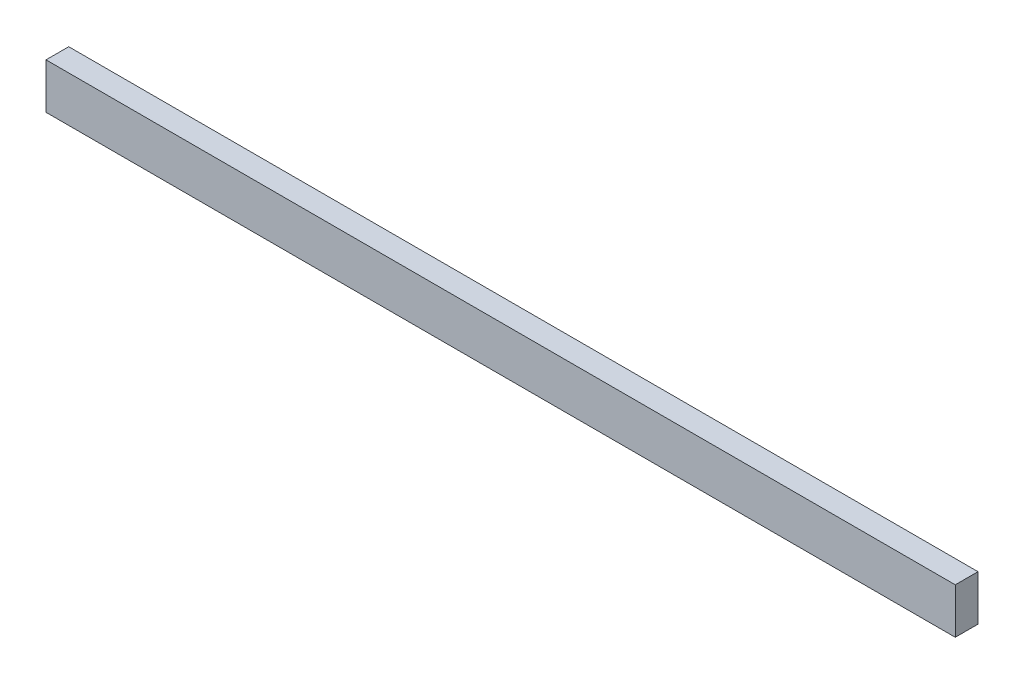
ISO-10303-21;
HEADER;
FILE_DESCRIPTION(('STEP AP214'),'2;1');
FILE_NAME('part.step','',(''),(''),'','','');
FILE_SCHEMA(('AUTOMOTIVE_DESIGN { 1 0 10303 214 1 1 1 1 }'));
ENDSEC;
DATA;
#1=APPLICATION_CONTEXT('core data for automotive mechanical design processes');
#2=APPLICATION_PROTOCOL_DEFINITION('international standard','automotive_design',2000,#1);
#3=PRODUCT_CONTEXT('',#1,'mechanical');
#4=PRODUCT('Part','Part','',(#3));
#5=PRODUCT_RELATED_PRODUCT_CATEGORY('part','',(#4));
#6=PRODUCT_DEFINITION_FORMATION('','',#4);
#7=PRODUCT_DEFINITION_CONTEXT('part definition',#1,'design');
#8=PRODUCT_DEFINITION('design','',#6,#7);
#9=PRODUCT_DEFINITION_SHAPE('','',#8);
#10=(LENGTH_UNIT() NAMED_UNIT(*) SI_UNIT(.MILLI.,.METRE.));
#11=(NAMED_UNIT(*) PLANE_ANGLE_UNIT() SI_UNIT($,.RADIAN.));
#12=(NAMED_UNIT(*) SI_UNIT($,.STERADIAN.) SOLID_ANGLE_UNIT());
#13=UNCERTAINTY_MEASURE_WITH_UNIT(LENGTH_MEASURE(1.E-05),#10,'distance_accuracy_value','');
#14=(GEOMETRIC_REPRESENTATION_CONTEXT(3) GLOBAL_UNCERTAINTY_ASSIGNED_CONTEXT((#13)) GLOBAL_UNIT_ASSIGNED_CONTEXT((#10,
#11,#12)) REPRESENTATION_CONTEXT('',''));
#15=CARTESIAN_POINT('',(0.,0.,0.));
#16=DIRECTION('',(0.,0.,1.));
#17=DIRECTION('',(1.,0.,0.));
#18=AXIS2_PLACEMENT_3D('',#15,#16,#17);
#19=CARTESIAN_POINT('',(127.,-6.35,6.35));
#20=DIRECTION('',(-1.,0.,0.));
#21=DIRECTION('',(0.,0.,1.));
#22=AXIS2_PLACEMENT_3D('',#19,#20,#21);
#23=PLANE('',#22);
#24=DIRECTION('',(0.,1.,0.));
#25=VECTOR('',#24,1.);
#26=CARTESIAN_POINT('',(127.,-6.35,0.));
#27=LINE('',#26,#25);
#28=CARTESIAN_POINT('',(127.,-6.35,0.));
#29=VERTEX_POINT('',#28);
#30=CARTESIAN_POINT('',(127.,6.35,0.));
#31=VERTEX_POINT('',#30);
#32=EDGE_CURVE('E111',#29,#31,#27,.T.);
#33=ORIENTED_EDGE('',*,*,#32,.T.);
#34=DIRECTION('',(0.,0.,-1.));
#35=VECTOR('',#34,1.);
#36=CARTESIAN_POINT('',(127.,6.35,6.35));
#37=LINE('',#36,#35);
#38=CARTESIAN_POINT('',(127.,6.35,6.35));
#39=VERTEX_POINT('',#38);
#40=EDGE_CURVE('E11',#39,#31,#37,.T.);
#41=ORIENTED_EDGE('',*,*,#40,.F.);
#42=DIRECTION('',(0.,1.,0.));
#43=VECTOR('',#42,1.);
#44=CARTESIAN_POINT('',(127.,-6.35,6.35));
#45=LINE('',#44,#43);
#46=CARTESIAN_POINT('',(127.,-6.35,6.35));
#47=VERTEX_POINT('',#46);
#48=EDGE_CURVE('E95',#47,#39,#45,.T.);
#49=ORIENTED_EDGE('',*,*,#48,.F.);
#50=DIRECTION('',(0.,0.,-1.));
#51=VECTOR('',#50,1.);
#52=CARTESIAN_POINT('',(127.,-6.35,6.35));
#53=LINE('',#52,#51);
#54=EDGE_CURVE('E107',#47,#29,#53,.T.);
#55=ORIENTED_EDGE('',*,*,#54,.T.);
#56=EDGE_LOOP('',(#33,#41,#49,#55));
#57=FACE_BOUND('',#56,.T.);
#58=ADVANCED_FACE('F43',(#57),#23,.F.);
#59=CARTESIAN_POINT('',(-127.,6.35,6.35));
#60=DIRECTION('',(0.,-1.,0.));
#61=DIRECTION('',(0.,0.,-1.));
#62=AXIS2_PLACEMENT_3D('',#59,#60,#61);
#63=PLANE('',#62);
#64=DIRECTION('',(-1.,0.,0.));
#65=VECTOR('',#64,1.);
#66=CARTESIAN_POINT('',(-127.,6.35,0.));
#67=LINE('',#66,#65);
#68=CARTESIAN_POINT('',(-127.,6.35,0.));
#69=VERTEX_POINT('',#68);
#70=EDGE_CURVE('E100',#31,#69,#67,.T.);
#71=ORIENTED_EDGE('',*,*,#70,.T.);
#72=DIRECTION('',(0.,0.,-1.));
#73=VECTOR('',#72,1.);
#74=CARTESIAN_POINT('',(-127.,6.35,6.35));
#75=LINE('',#74,#73);
#76=CARTESIAN_POINT('',(-127.,6.35,6.35));
#77=VERTEX_POINT('',#76);
#78=EDGE_CURVE('E52',#77,#69,#75,.T.);
#79=ORIENTED_EDGE('',*,*,#78,.F.);
#80=DIRECTION('',(-1.,0.,0.));
#81=VECTOR('',#80,1.);
#82=CARTESIAN_POINT('',(-127.,6.35,6.35));
#83=LINE('',#82,#81);
#84=EDGE_CURVE('E90',#39,#77,#83,.T.);
#85=ORIENTED_EDGE('',*,*,#84,.F.);
#86=ORIENTED_EDGE('',*,*,#40,.T.);
#87=EDGE_LOOP('',(#71,#79,#85,#86));
#88=FACE_BOUND('',#87,.T.);
#89=ADVANCED_FACE('F99',(#88),#63,.F.);
#90=CARTESIAN_POINT('',(-127.,-6.35,6.35));
#91=DIRECTION('',(1.,0.,0.));
#92=DIRECTION('',(0.,0.,-1.));
#93=AXIS2_PLACEMENT_3D('',#90,#91,#92);
#94=PLANE('',#93);
#95=DIRECTION('',(0.,-1.,0.));
#96=VECTOR('',#95,1.);
#97=CARTESIAN_POINT('',(-127.,-6.35,0.));
#98=LINE('',#97,#96);
#99=CARTESIAN_POINT('',(-127.,-6.35,0.));
#100=VERTEX_POINT('',#99);
#101=EDGE_CURVE('E77',#69,#100,#98,.T.);
#102=ORIENTED_EDGE('',*,*,#101,.T.);
#103=DIRECTION('',(0.,0.,-1.));
#104=VECTOR('',#103,1.);
#105=CARTESIAN_POINT('',(-127.,-6.35,6.35));
#106=LINE('',#105,#104);
#107=CARTESIAN_POINT('',(-127.,-6.35,6.35));
#108=VERTEX_POINT('',#107);
#109=EDGE_CURVE('E102',#108,#100,#106,.T.);
#110=ORIENTED_EDGE('',*,*,#109,.F.);
#111=DIRECTION('',(0.,-1.,0.));
#112=VECTOR('',#111,1.);
#113=CARTESIAN_POINT('',(-127.,-6.35,6.35));
#114=LINE('',#113,#112);
#115=EDGE_CURVE('E93',#77,#108,#114,.T.);
#116=ORIENTED_EDGE('',*,*,#115,.F.);
#117=ORIENTED_EDGE('',*,*,#78,.T.);
#118=EDGE_LOOP('',(#102,#110,#116,#117));
#119=FACE_BOUND('',#118,.T.);
#120=ADVANCED_FACE('F103',(#119),#94,.F.);
#121=CARTESIAN_POINT('',(-127.,-6.35,6.35));
#122=DIRECTION('',(0.,1.,0.));
#123=DIRECTION('',(0.,0.,1.));
#124=AXIS2_PLACEMENT_3D('',#121,#122,#123);
#125=PLANE('',#124);
#126=DIRECTION('',(1.,0.,0.));
#127=VECTOR('',#126,1.);
#128=CARTESIAN_POINT('',(-127.,-6.35,0.));
#129=LINE('',#128,#127);
#130=EDGE_CURVE('E83',#100,#29,#129,.T.);
#131=ORIENTED_EDGE('',*,*,#130,.T.);
#132=ORIENTED_EDGE('',*,*,#54,.F.);
#133=DIRECTION('',(1.,0.,0.));
#134=VECTOR('',#133,1.);
#135=CARTESIAN_POINT('',(-127.,-6.35,6.35));
#136=LINE('',#135,#134);
#137=EDGE_CURVE('E60',#108,#47,#136,.T.);
#138=ORIENTED_EDGE('',*,*,#137,.F.);
#139=ORIENTED_EDGE('',*,*,#109,.T.);
#140=EDGE_LOOP('',(#131,#132,#138,#139));
#141=FACE_BOUND('',#140,.T.);
#142=ADVANCED_FACE('F124',(#141),#125,.F.);
#143=CARTESIAN_POINT('',(0.,0.,6.35));
#144=DIRECTION('',(0.,0.,-1.));
#145=DIRECTION('',(-1.,0.,0.));
#146=AXIS2_PLACEMENT_3D('',#143,#144,#145);
#147=PLANE('',#146);
#148=ORIENTED_EDGE('',*,*,#48,.T.);
#149=ORIENTED_EDGE('',*,*,#84,.T.);
#150=ORIENTED_EDGE('',*,*,#115,.T.);
#151=ORIENTED_EDGE('',*,*,#137,.T.);
#152=EDGE_LOOP('',(#148,#149,#150,#151));
#153=FACE_BOUND('',#152,.T.);
#154=ADVANCED_FACE('F91',(#153),#147,.F.);
#155=CARTESIAN_POINT('',(0.,0.,0.));
#156=DIRECTION('',(0.,0.,-1.));
#157=DIRECTION('',(-1.,0.,0.));
#158=AXIS2_PLACEMENT_3D('',#155,#156,#157);
#159=PLANE('',#158);
#160=ORIENTED_EDGE('',*,*,#32,.F.);
#161=ORIENTED_EDGE('',*,*,#130,.F.);
#162=ORIENTED_EDGE('',*,*,#101,.F.);
#163=ORIENTED_EDGE('',*,*,#70,.F.);
#164=EDGE_LOOP('',(#160,#161,#162,#163));
#165=FACE_BOUND('',#164,.T.);
#166=ADVANCED_FACE('F127',(#165),#159,.T.);
#167=CLOSED_SHELL('',(#58,#89,#120,#142,#154,#166));
#168=MANIFOLD_SOLID_BREP('B2',#167);
#169=ADVANCED_BREP_SHAPE_REPRESENTATION('',(#18,#168),#14);
#170=SHAPE_DEFINITION_REPRESENTATION(#9,#169);
ENDSEC;
END-ISO-10303-21;
